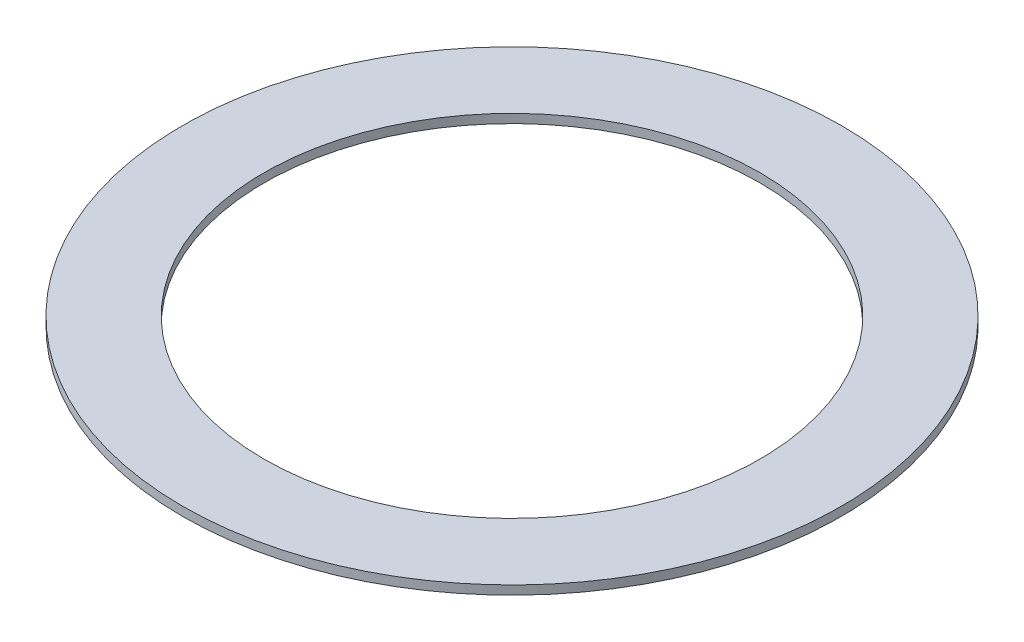
ISO-10303-21;
HEADER;
FILE_DESCRIPTION(('STEP AP214'),'2;1');
FILE_NAME('part.step','',(''),(''),'','','');
FILE_SCHEMA(('AUTOMOTIVE_DESIGN { 1 0 10303 214 1 1 1 1 }'));
ENDSEC;
DATA;
#1=APPLICATION_CONTEXT('core data for automotive mechanical design processes');
#2=APPLICATION_PROTOCOL_DEFINITION('international standard','automotive_design',2000,#1);
#3=PRODUCT_CONTEXT('',#1,'mechanical');
#4=PRODUCT('Part','Part','',(#3));
#5=PRODUCT_RELATED_PRODUCT_CATEGORY('part','',(#4));
#6=PRODUCT_DEFINITION_FORMATION('','',#4);
#7=PRODUCT_DEFINITION_CONTEXT('part definition',#1,'design');
#8=PRODUCT_DEFINITION('design','',#6,#7);
#9=PRODUCT_DEFINITION_SHAPE('','',#8);
#10=(LENGTH_UNIT() NAMED_UNIT(*) SI_UNIT(.MILLI.,.METRE.));
#11=(NAMED_UNIT(*) PLANE_ANGLE_UNIT() SI_UNIT($,.RADIAN.));
#12=(NAMED_UNIT(*) SI_UNIT($,.STERADIAN.) SOLID_ANGLE_UNIT());
#13=UNCERTAINTY_MEASURE_WITH_UNIT(LENGTH_MEASURE(1.E-05),#10,'distance_accuracy_value','');
#14=(GEOMETRIC_REPRESENTATION_CONTEXT(3) GLOBAL_UNCERTAINTY_ASSIGNED_CONTEXT((#13)) GLOBAL_UNIT_ASSIGNED_CONTEXT((#10,
#11,#12)) REPRESENTATION_CONTEXT('',''));
#15=CARTESIAN_POINT('',(0.,0.,0.));
#16=DIRECTION('',(0.,0.,1.));
#17=DIRECTION('',(1.,0.,0.));
#18=AXIS2_PLACEMENT_3D('',#15,#16,#17);
#19=CARTESIAN_POINT('',(0.,3.175,0.));
#20=DIRECTION('',(0.,1.,0.));
#21=DIRECTION('',(0.,0.,1.));
#22=AXIS2_PLACEMENT_3D('',#19,#20,#21);
#23=PLANE('',#22);
#24=CARTESIAN_POINT('',(0.,3.175,0.));
#25=DIRECTION('',(0.,1.,0.));
#26=DIRECTION('',(0.,0.,1.));
#27=AXIS2_PLACEMENT_3D('',#24,#25,#26);
#28=CIRCLE('',#27,118.11);
#29=CARTESIAN_POINT('',(0.,3.175,118.11));
#30=VERTEX_POINT('',#29);
#31=EDGE_CURVE('E10',#30,#30,#28,.T.);
#32=ORIENTED_EDGE('',*,*,#31,.T.);
#33=EDGE_LOOP('',(#32));
#34=FACE_BOUND('',#33,.T.);
#35=CARTESIAN_POINT('',(0.,3.175,0.));
#36=DIRECTION('',(0.,1.,0.));
#37=DIRECTION('',(0.,0.,1.));
#38=AXIS2_PLACEMENT_3D('',#35,#36,#37);
#39=CIRCLE('',#38,88.9);
#40=CARTESIAN_POINT('',(0.,3.175,88.9));
#41=VERTEX_POINT('',#40);
#42=EDGE_CURVE('E50',#41,#41,#39,.T.);
#43=ORIENTED_EDGE('',*,*,#42,.F.);
#44=EDGE_LOOP('',(#43));
#45=FACE_BOUND('',#44,.T.);
#46=ADVANCED_FACE('F37',(#34,#45),#23,.T.);
#47=CARTESIAN_POINT('',(0.,0.,0.));
#48=DIRECTION('',(0.,1.,0.));
#49=DIRECTION('',(0.,0.,1.));
#50=AXIS2_PLACEMENT_3D('',#47,#48,#49);
#51=PLANE('',#50);
#52=CARTESIAN_POINT('',(0.,0.,0.));
#53=DIRECTION('',(0.,1.,0.));
#54=DIRECTION('',(0.,0.,1.));
#55=AXIS2_PLACEMENT_3D('',#52,#53,#54);
#56=CIRCLE('',#55,118.11);
#57=CARTESIAN_POINT('',(0.,0.,118.11));
#58=VERTEX_POINT('',#57);
#59=EDGE_CURVE('E41',#58,#58,#56,.T.);
#60=ORIENTED_EDGE('',*,*,#59,.F.);
#61=EDGE_LOOP('',(#60));
#62=FACE_BOUND('',#61,.T.);
#63=CARTESIAN_POINT('',(0.,0.,0.));
#64=DIRECTION('',(0.,1.,0.));
#65=DIRECTION('',(0.,0.,1.));
#66=AXIS2_PLACEMENT_3D('',#63,#64,#65);
#67=CIRCLE('',#66,88.9);
#68=CARTESIAN_POINT('',(0.,0.,88.9));
#69=VERTEX_POINT('',#68);
#70=EDGE_CURVE('E52',#69,#69,#67,.T.);
#71=ORIENTED_EDGE('',*,*,#70,.T.);
#72=EDGE_LOOP('',(#71));
#73=FACE_BOUND('',#72,.T.);
#74=ADVANCED_FACE('F64',(#62,#73),#51,.F.);
#75=CARTESIAN_POINT('',(0.,3.175,0.));
#76=DIRECTION('',(0.,-1.,0.));
#77=DIRECTION('',(0.,0.,-1.));
#78=AXIS2_PLACEMENT_3D('',#75,#76,#77);
#79=CYLINDRICAL_SURFACE('',#78,118.11);
#80=ORIENTED_EDGE('',*,*,#31,.F.);
#81=EDGE_LOOP('',(#80));
#82=FACE_BOUND('',#81,.T.);
#83=ORIENTED_EDGE('',*,*,#59,.T.);
#84=EDGE_LOOP('',(#83));
#85=FACE_BOUND('',#84,.T.);
#86=ADVANCED_FACE('F39',(#82,#85),#79,.T.);
#87=CARTESIAN_POINT('',(0.,3.175,0.));
#88=DIRECTION('',(0.,-1.,0.));
#89=DIRECTION('',(0.,0.,-1.));
#90=AXIS2_PLACEMENT_3D('',#87,#88,#89);
#91=CYLINDRICAL_SURFACE('',#90,88.9);
#92=ORIENTED_EDGE('',*,*,#42,.T.);
#93=EDGE_LOOP('',(#92));
#94=FACE_BOUND('',#93,.T.);
#95=ORIENTED_EDGE('',*,*,#70,.F.);
#96=EDGE_LOOP('',(#95));
#97=FACE_BOUND('',#96,.T.);
#98=ADVANCED_FACE('F60',(#94,#97),#91,.F.);
#99=CLOSED_SHELL('',(#46,#74,#86,#98));
#100=MANIFOLD_SOLID_BREP('B2',#99);
#101=ADVANCED_BREP_SHAPE_REPRESENTATION('',(#18,#100),#14);
#102=SHAPE_DEFINITION_REPRESENTATION(#9,#101);
ENDSEC;
END-ISO-10303-21;
